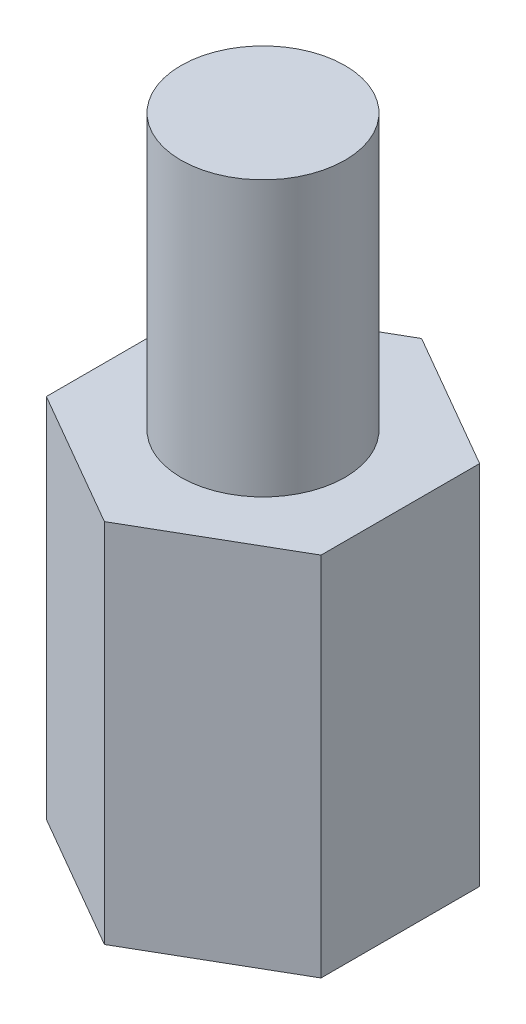
ISO-10303-21;
HEADER;
FILE_DESCRIPTION(('STEP AP214'),'2;1');
FILE_NAME('part.step','',(''),(''),'','','');
FILE_SCHEMA(('AUTOMOTIVE_DESIGN { 1 0 10303 214 1 1 1 1 }'));
ENDSEC;
DATA;
#1=APPLICATION_CONTEXT('core data for automotive mechanical design processes');
#2=APPLICATION_PROTOCOL_DEFINITION('international standard','automotive_design',2000,#1);
#3=PRODUCT_CONTEXT('',#1,'mechanical');
#4=PRODUCT('Part','Part','',(#3));
#5=PRODUCT_RELATED_PRODUCT_CATEGORY('part','',(#4));
#6=PRODUCT_DEFINITION_FORMATION('','',#4);
#7=PRODUCT_DEFINITION_CONTEXT('part definition',#1,'design');
#8=PRODUCT_DEFINITION('design','',#6,#7);
#9=PRODUCT_DEFINITION_SHAPE('','',#8);
#10=(LENGTH_UNIT() NAMED_UNIT(*) SI_UNIT(.MILLI.,.METRE.));
#11=(NAMED_UNIT(*) PLANE_ANGLE_UNIT() SI_UNIT($,.RADIAN.));
#12=(NAMED_UNIT(*) SI_UNIT($,.STERADIAN.) SOLID_ANGLE_UNIT());
#13=UNCERTAINTY_MEASURE_WITH_UNIT(LENGTH_MEASURE(1.E-05),#10,'distance_accuracy_value','');
#14=(GEOMETRIC_REPRESENTATION_CONTEXT(3) GLOBAL_UNCERTAINTY_ASSIGNED_CONTEXT((#13)) GLOBAL_UNIT_ASSIGNED_CONTEXT((#10,
#11,#12)) REPRESENTATION_CONTEXT('',''));
#15=CARTESIAN_POINT('',(0.,0.,0.));
#16=DIRECTION('',(0.,0.,1.));
#17=DIRECTION('',(1.,0.,0.));
#18=AXIS2_PLACEMENT_3D('',#15,#16,#17);
#19=CARTESIAN_POINT('',(0.,6.35,-2.74963065701559));
#20=DIRECTION('',(0.500000000000001,0.,0.866025403784438));
#21=DIRECTION('',(0.866025403784438,0.,-0.500000000000001));
#22=AXIS2_PLACEMENT_3D('',#19,#20,#21);
#23=PLANE('',#22);
#24=DIRECTION('',(-0.866025403784438,0.,0.500000000000001));
#25=VECTOR('',#24,1.);
#26=CARTESIAN_POINT('',(0.,0.,-2.74963065701559));
#27=LINE('',#26,#25);
#28=CARTESIAN_POINT('',(0.,0.,-2.74963065701559));
#29=VERTEX_POINT('',#28);
#30=CARTESIAN_POINT('',(-2.38125,0.,-1.37481532850779));
#31=VERTEX_POINT('',#30);
#32=EDGE_CURVE('E117',#29,#31,#27,.T.);
#33=ORIENTED_EDGE('',*,*,#32,.T.);
#34=DIRECTION('',(0.,-1.,0.));
#35=VECTOR('',#34,1.);
#36=CARTESIAN_POINT('',(-2.38125,6.35,-1.37481532850779));
#37=LINE('',#36,#35);
#38=CARTESIAN_POINT('',(-2.38125,6.35,-1.37481532850779));
#39=VERTEX_POINT('',#38);
#40=EDGE_CURVE('E11',#39,#31,#37,.T.);
#41=ORIENTED_EDGE('',*,*,#40,.F.);
#42=DIRECTION('',(-0.866025403784438,0.,0.500000000000001));
#43=VECTOR('',#42,1.);
#44=CARTESIAN_POINT('',(0.,6.35,-2.74963065701559));
#45=LINE('',#44,#43);
#46=CARTESIAN_POINT('',(0.,6.35,-2.74963065701559));
#47=VERTEX_POINT('',#46);
#48=EDGE_CURVE('E128',#47,#39,#45,.T.);
#49=ORIENTED_EDGE('',*,*,#48,.F.);
#50=DIRECTION('',(0.,-1.,0.));
#51=VECTOR('',#50,1.);
#52=CARTESIAN_POINT('',(0.,6.35,-2.74963065701559));
#53=LINE('',#52,#51);
#54=EDGE_CURVE('E113',#47,#29,#53,.T.);
#55=ORIENTED_EDGE('',*,*,#54,.T.);
#56=EDGE_LOOP('',(#33,#41,#49,#55));
#57=FACE_BOUND('',#56,.T.);
#58=ADVANCED_FACE('F33',(#57),#23,.F.);
#59=CARTESIAN_POINT('',(-2.38125,6.35,-1.37481532850779));
#60=DIRECTION('',(1.,0.,0.));
#61=DIRECTION('',(0.,0.,-1.));
#62=AXIS2_PLACEMENT_3D('',#59,#60,#61);
#63=PLANE('',#62);
#64=DIRECTION('',(0.,0.,1.));
#65=VECTOR('',#64,1.);
#66=CARTESIAN_POINT('',(-2.38125,0.,-1.37481532850779));
#67=LINE('',#66,#65);
#68=CARTESIAN_POINT('',(-2.38125,0.,1.3748153285078));
#69=VERTEX_POINT('',#68);
#70=EDGE_CURVE('E120',#31,#69,#67,.T.);
#71=ORIENTED_EDGE('',*,*,#70,.T.);
#72=DIRECTION('',(0.,-1.,0.));
#73=VECTOR('',#72,1.);
#74=CARTESIAN_POINT('',(-2.38125,6.35,1.3748153285078));
#75=LINE('',#74,#73);
#76=CARTESIAN_POINT('',(-2.38125,6.35,1.3748153285078));
#77=VERTEX_POINT('',#76);
#78=EDGE_CURVE('E41',#77,#69,#75,.T.);
#79=ORIENTED_EDGE('',*,*,#78,.F.);
#80=DIRECTION('',(0.,0.,1.));
#81=VECTOR('',#80,1.);
#82=CARTESIAN_POINT('',(-2.38125,6.35,-1.37481532850779));
#83=LINE('',#82,#81);
#84=EDGE_CURVE('E86',#39,#77,#83,.T.);
#85=ORIENTED_EDGE('',*,*,#84,.F.);
#86=ORIENTED_EDGE('',*,*,#40,.T.);
#87=EDGE_LOOP('',(#71,#79,#85,#86));
#88=FACE_BOUND('',#87,.T.);
#89=ADVANCED_FACE('F153',(#88),#63,.F.);
#90=CARTESIAN_POINT('',(-2.38125,6.35,1.3748153285078));
#91=DIRECTION('',(0.499999999999999,0.,-0.866025403784439));
#92=DIRECTION('',(-0.866025403784439,0.,-0.499999999999999));
#93=AXIS2_PLACEMENT_3D('',#90,#91,#92);
#94=PLANE('',#93);
#95=DIRECTION('',(0.866025403784439,0.,0.499999999999999));
#96=VECTOR('',#95,1.);
#97=CARTESIAN_POINT('',(-2.38125,0.,1.3748153285078));
#98=LINE('',#97,#96);
#99=CARTESIAN_POINT('',(0.,0.,2.74963065701559));
#100=VERTEX_POINT('',#99);
#101=EDGE_CURVE('E123',#69,#100,#98,.T.);
#102=ORIENTED_EDGE('',*,*,#101,.T.);
#103=DIRECTION('',(0.,-1.,0.));
#104=VECTOR('',#103,1.);
#105=CARTESIAN_POINT('',(0.,6.35,2.74963065701559));
#106=LINE('',#105,#104);
#107=CARTESIAN_POINT('',(0.,6.35,2.74963065701559));
#108=VERTEX_POINT('',#107);
#109=EDGE_CURVE('E108',#108,#100,#106,.T.);
#110=ORIENTED_EDGE('',*,*,#109,.F.);
#111=DIRECTION('',(0.866025403784439,0.,0.499999999999999));
#112=VECTOR('',#111,1.);
#113=CARTESIAN_POINT('',(-2.38125,6.35,1.3748153285078));
#114=LINE('',#113,#112);
#115=EDGE_CURVE('E99',#77,#108,#114,.T.);
#116=ORIENTED_EDGE('',*,*,#115,.F.);
#117=ORIENTED_EDGE('',*,*,#78,.T.);
#118=EDGE_LOOP('',(#102,#110,#116,#117));
#119=FACE_BOUND('',#118,.T.);
#120=ADVANCED_FACE('F134',(#119),#94,.F.);
#121=CARTESIAN_POINT('',(0.,6.35,2.74963065701559));
#122=DIRECTION('',(-0.5,0.,-0.866025403784438));
#123=DIRECTION('',(-0.866025403784438,0.,0.5));
#124=AXIS2_PLACEMENT_3D('',#121,#122,#123);
#125=PLANE('',#124);
#126=DIRECTION('',(0.866025403784438,0.,-0.5));
#127=VECTOR('',#126,1.);
#128=CARTESIAN_POINT('',(0.,0.,2.74963065701559));
#129=LINE('',#128,#127);
#130=CARTESIAN_POINT('',(2.38125,0.,1.37481532850779));
#131=VERTEX_POINT('',#130);
#132=EDGE_CURVE('E107',#100,#131,#129,.T.);
#133=ORIENTED_EDGE('',*,*,#132,.T.);
#134=DIRECTION('',(0.,-1.,0.));
#135=VECTOR('',#134,1.);
#136=CARTESIAN_POINT('',(2.38125,6.35,1.37481532850779));
#137=LINE('',#136,#135);
#138=CARTESIAN_POINT('',(2.38125,6.35,1.37481532850779));
#139=VERTEX_POINT('',#138);
#140=EDGE_CURVE('E104',#139,#131,#137,.T.);
#141=ORIENTED_EDGE('',*,*,#140,.F.);
#142=DIRECTION('',(0.866025403784438,0.,-0.5));
#143=VECTOR('',#142,1.);
#144=CARTESIAN_POINT('',(0.,6.35,2.74963065701559));
#145=LINE('',#144,#143);
#146=EDGE_CURVE('E93',#108,#139,#145,.T.);
#147=ORIENTED_EDGE('',*,*,#146,.F.);
#148=ORIENTED_EDGE('',*,*,#109,.T.);
#149=EDGE_LOOP('',(#133,#141,#147,#148));
#150=FACE_BOUND('',#149,.T.);
#151=ADVANCED_FACE('F105',(#150),#125,.F.);
#152=CARTESIAN_POINT('',(2.38125,6.35,1.37481532850779));
#153=DIRECTION('',(-1.,0.,0.));
#154=DIRECTION('',(0.,0.,1.));
#155=AXIS2_PLACEMENT_3D('',#152,#153,#154);
#156=PLANE('',#155);
#157=DIRECTION('',(0.,0.,-1.));
#158=VECTOR('',#157,1.);
#159=CARTESIAN_POINT('',(2.38125,0.,1.37481532850779));
#160=LINE('',#159,#158);
#161=CARTESIAN_POINT('',(2.38125,0.,-1.3748153285078));
#162=VERTEX_POINT('',#161);
#163=EDGE_CURVE('E72',#131,#162,#160,.T.);
#164=ORIENTED_EDGE('',*,*,#163,.T.);
#165=DIRECTION('',(0.,-1.,0.));
#166=VECTOR('',#165,1.);
#167=CARTESIAN_POINT('',(2.38125,6.35,-1.3748153285078));
#168=LINE('',#167,#166);
#169=CARTESIAN_POINT('',(2.38125,6.35,-1.3748153285078));
#170=VERTEX_POINT('',#169);
#171=EDGE_CURVE('E109',#170,#162,#168,.T.);
#172=ORIENTED_EDGE('',*,*,#171,.F.);
#173=DIRECTION('',(0.,0.,-1.));
#174=VECTOR('',#173,1.);
#175=CARTESIAN_POINT('',(2.38125,6.35,1.37481532850779));
#176=LINE('',#175,#174);
#177=EDGE_CURVE('E97',#139,#170,#176,.T.);
#178=ORIENTED_EDGE('',*,*,#177,.F.);
#179=ORIENTED_EDGE('',*,*,#140,.T.);
#180=EDGE_LOOP('',(#164,#172,#178,#179));
#181=FACE_BOUND('',#180,.T.);
#182=ADVANCED_FACE('F111',(#181),#156,.F.);
#183=CARTESIAN_POINT('',(2.38125,6.35,-1.3748153285078));
#184=DIRECTION('',(-0.499999999999999,0.,0.866025403784439));
#185=DIRECTION('',(0.866025403784439,0.,0.5));
#186=AXIS2_PLACEMENT_3D('',#183,#184,#185);
#187=PLANE('',#186);
#188=DIRECTION('',(-0.866025403784439,0.,-0.499999999999999));
#189=VECTOR('',#188,1.);
#190=CARTESIAN_POINT('',(2.38125,0.,-1.3748153285078));
#191=LINE('',#190,#189);
#192=EDGE_CURVE('E78',#162,#29,#191,.T.);
#193=ORIENTED_EDGE('',*,*,#192,.T.);
#194=ORIENTED_EDGE('',*,*,#54,.F.);
#195=DIRECTION('',(-0.866025403784439,0.,-0.499999999999999));
#196=VECTOR('',#195,1.);
#197=CARTESIAN_POINT('',(2.38125,6.35,-1.3748153285078));
#198=LINE('',#197,#196);
#199=EDGE_CURVE('E49',#170,#47,#198,.T.);
#200=ORIENTED_EDGE('',*,*,#199,.F.);
#201=ORIENTED_EDGE('',*,*,#171,.T.);
#202=EDGE_LOOP('',(#193,#194,#200,#201));
#203=FACE_BOUND('',#202,.T.);
#204=ADVANCED_FACE('F141',(#203),#187,.F.);
#205=CARTESIAN_POINT('',(0.,6.35,0.));
#206=DIRECTION('',(0.,1.,0.));
#207=DIRECTION('',(0.,0.,1.));
#208=AXIS2_PLACEMENT_3D('',#205,#206,#207);
#209=PLANE('',#208);
#210=CARTESIAN_POINT('',(0.,6.35,0.));
#211=DIRECTION('',(0.,1.,0.));
#212=DIRECTION('',(0.,0.,1.));
#213=AXIS2_PLACEMENT_3D('',#210,#211,#212);
#214=CIRCLE('',#213,1.4224);
#215=CARTESIAN_POINT('',(0.,6.35,1.4224));
#216=VERTEX_POINT('',#215);
#217=EDGE_CURVE('E236',#216,#216,#214,.T.);
#218=ORIENTED_EDGE('',*,*,#217,.F.);
#219=EDGE_LOOP('',(#218));
#220=FACE_BOUND('',#219,.T.);
#221=ORIENTED_EDGE('',*,*,#48,.T.);
#222=ORIENTED_EDGE('',*,*,#84,.T.);
#223=ORIENTED_EDGE('',*,*,#115,.T.);
#224=ORIENTED_EDGE('',*,*,#146,.T.);
#225=ORIENTED_EDGE('',*,*,#177,.T.);
#226=ORIENTED_EDGE('',*,*,#199,.T.);
#227=EDGE_LOOP('',(#221,#222,#223,#224,#225,#226));
#228=FACE_BOUND('',#227,.T.);
#229=ADVANCED_FACE('F95',(#220,#228),#209,.T.);
#230=CARTESIAN_POINT('',(0.,0.,0.));
#231=DIRECTION('',(0.,1.,0.));
#232=DIRECTION('',(0.,0.,1.));
#233=AXIS2_PLACEMENT_3D('',#230,#231,#232);
#234=PLANE('',#233);
#235=CARTESIAN_POINT('',(0.,0.,0.));
#236=DIRECTION('',(0.,-1.,0.));
#237=DIRECTION('',(0.,0.,-1.));
#238=AXIS2_PLACEMENT_3D('',#235,#236,#237);
#239=CIRCLE('',#238,1.4224);
#240=CARTESIAN_POINT('',(0.,0.,-1.4224));
#241=VERTEX_POINT('',#240);
#242=EDGE_CURVE('E237',#241,#241,#239,.T.);
#243=ORIENTED_EDGE('',*,*,#242,.F.);
#244=EDGE_LOOP('',(#243));
#245=FACE_BOUND('',#244,.T.);
#246=ORIENTED_EDGE('',*,*,#32,.F.);
#247=ORIENTED_EDGE('',*,*,#192,.F.);
#248=ORIENTED_EDGE('',*,*,#163,.F.);
#249=ORIENTED_EDGE('',*,*,#132,.F.);
#250=ORIENTED_EDGE('',*,*,#101,.F.);
#251=ORIENTED_EDGE('',*,*,#70,.F.);
#252=EDGE_LOOP('',(#246,#247,#248,#249,#250,#251));
#253=FACE_BOUND('',#252,.T.);
#254=ADVANCED_FACE('F137',(#245,#253),#234,.F.);
#255=CARTESIAN_POINT('',(0.,11.1125,0.));
#256=DIRECTION('',(0.,-1.,0.));
#257=DIRECTION('',(0.,0.,-1.));
#258=AXIS2_PLACEMENT_3D('',#255,#256,#257);
#259=CYLINDRICAL_SURFACE('',#258,1.4224);
#260=CARTESIAN_POINT('',(0.,11.1125,0.));
#261=DIRECTION('',(0.,1.,0.));
#262=DIRECTION('',(0.,0.,1.));
#263=AXIS2_PLACEMENT_3D('',#260,#261,#262);
#264=CIRCLE('',#263,1.4224);
#265=CARTESIAN_POINT('',(0.,11.1125,1.4224));
#266=VERTEX_POINT('',#265);
#267=EDGE_CURVE('E121',#266,#266,#264,.T.);
#268=ORIENTED_EDGE('',*,*,#267,.F.);
#269=EDGE_LOOP('',(#268));
#270=FACE_BOUND('',#269,.T.);
#271=ORIENTED_EDGE('',*,*,#217,.T.);
#272=EDGE_LOOP('',(#271));
#273=FACE_BOUND('',#272,.T.);
#274=ADVANCED_FACE('F188',(#270,#273),#259,.T.);
#275=CARTESIAN_POINT('',(0.,11.1125,0.));
#276=DIRECTION('',(0.,1.,0.));
#277=DIRECTION('',(0.,0.,1.));
#278=AXIS2_PLACEMENT_3D('',#275,#276,#277);
#279=PLANE('',#278);
#280=ORIENTED_EDGE('',*,*,#267,.T.);
#281=EDGE_LOOP('',(#280));
#282=FACE_BOUND('',#281,.T.);
#283=ADVANCED_FACE('F193',(#282),#279,.T.);
#284=CARTESIAN_POINT('',(0.,4.7625,0.));
#285=DIRECTION('',(0.,-1.,0.));
#286=DIRECTION('',(0.,0.,-1.));
#287=AXIS2_PLACEMENT_3D('',#284,#285,#286);
#288=CYLINDRICAL_SURFACE('',#287,1.4224);
#289=CARTESIAN_POINT('',(0.,4.7625,0.));
#290=DIRECTION('',(0.,-1.,0.));
#291=DIRECTION('',(0.,0.,-1.));
#292=AXIS2_PLACEMENT_3D('',#289,#290,#291);
#293=CIRCLE('',#292,1.4224);
#294=CARTESIAN_POINT('',(0.,4.7625,-1.4224));
#295=VERTEX_POINT('',#294);
#296=EDGE_CURVE('E235',#295,#295,#293,.T.);
#297=ORIENTED_EDGE('',*,*,#296,.F.);
#298=EDGE_LOOP('',(#297));
#299=FACE_BOUND('',#298,.T.);
#300=ORIENTED_EDGE('',*,*,#242,.T.);
#301=EDGE_LOOP('',(#300));
#302=FACE_BOUND('',#301,.T.);
#303=ADVANCED_FACE('F203',(#299,#302),#288,.F.);
#304=CARTESIAN_POINT('',(0.,4.7625,0.));
#305=DIRECTION('',(0.,-1.,0.));
#306=DIRECTION('',(0.,0.,-1.));
#307=AXIS2_PLACEMENT_3D('',#304,#305,#306);
#308=PLANE('',#307);
#309=ORIENTED_EDGE('',*,*,#296,.T.);
#310=EDGE_LOOP('',(#309));
#311=FACE_BOUND('',#310,.T.);
#312=ADVANCED_FACE('F219',(#311),#308,.T.);
#313=CLOSED_SHELL('',(#58,#89,#120,#151,#182,#204,#229,#254,#274,#283,#303,#312));
#314=MANIFOLD_SOLID_BREP('B2',#313);
#315=ADVANCED_BREP_SHAPE_REPRESENTATION('',(#18,#314),#14);
#316=SHAPE_DEFINITION_REPRESENTATION(#9,#315);
ENDSEC;
END-ISO-10303-21;
